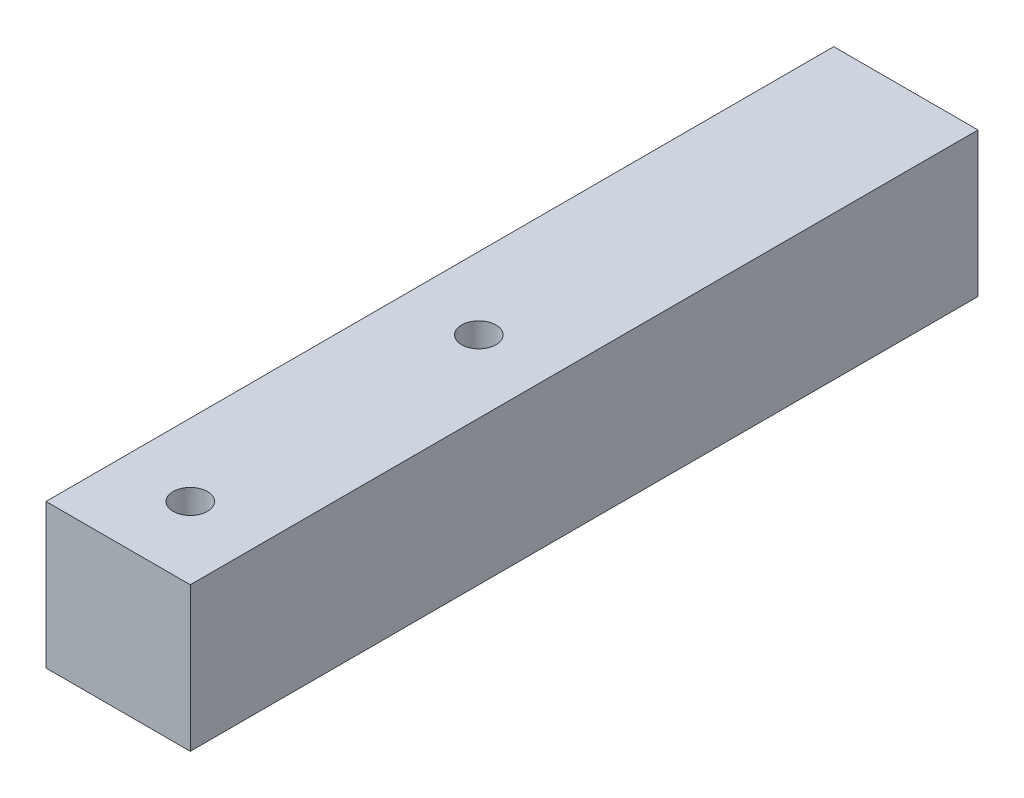
ISO-10303-21;
HEADER;
FILE_DESCRIPTION(('STEP AP214'),'2;1');
FILE_NAME('part.step','',(''),(''),'','','');
FILE_SCHEMA(('AUTOMOTIVE_DESIGN { 1 0 10303 214 1 1 1 1 }'));
ENDSEC;
DATA;
#1=APPLICATION_CONTEXT('core data for automotive mechanical design processes');
#2=APPLICATION_PROTOCOL_DEFINITION('international standard','automotive_design',2000,#1);
#3=PRODUCT_CONTEXT('',#1,'mechanical');
#4=PRODUCT('Part','Part','',(#3));
#5=PRODUCT_RELATED_PRODUCT_CATEGORY('part','',(#4));
#6=PRODUCT_DEFINITION_FORMATION('','',#4);
#7=PRODUCT_DEFINITION_CONTEXT('part definition',#1,'design');
#8=PRODUCT_DEFINITION('design','',#6,#7);
#9=PRODUCT_DEFINITION_SHAPE('','',#8);
#10=(LENGTH_UNIT() NAMED_UNIT(*) SI_UNIT(.MILLI.,.METRE.));
#11=(NAMED_UNIT(*) PLANE_ANGLE_UNIT() SI_UNIT($,.RADIAN.));
#12=(NAMED_UNIT(*) SI_UNIT($,.STERADIAN.) SOLID_ANGLE_UNIT());
#13=UNCERTAINTY_MEASURE_WITH_UNIT(LENGTH_MEASURE(1.E-05),#10,'distance_accuracy_value','');
#14=(GEOMETRIC_REPRESENTATION_CONTEXT(3) GLOBAL_UNCERTAINTY_ASSIGNED_CONTEXT((#13)) GLOBAL_UNIT_ASSIGNED_CONTEXT((#10,
#11,#12)) REPRESENTATION_CONTEXT('',''));
#15=CARTESIAN_POINT('',(0.,0.,0.));
#16=DIRECTION('',(0.,0.,1.));
#17=DIRECTION('',(1.,0.,0.));
#18=AXIS2_PLACEMENT_3D('',#15,#16,#17);
#19=CARTESIAN_POINT('',(12.7,-12.7,69.341499747));
#20=DIRECTION('',(-1.,0.,0.));
#21=DIRECTION('',(0.,0.,1.));
#22=AXIS2_PLACEMENT_3D('',#19,#20,#21);
#23=PLANE('',#22);
#24=DIRECTION('',(0.,1.,0.));
#25=VECTOR('',#24,1.);
#26=CARTESIAN_POINT('',(12.7,-12.7,-69.341499747));
#27=LINE('',#26,#25);
#28=CARTESIAN_POINT('',(12.7,-12.7,-69.341499747));
#29=VERTEX_POINT('',#28);
#30=CARTESIAN_POINT('',(12.7,12.7,-69.341499747));
#31=VERTEX_POINT('',#30);
#32=EDGE_CURVE('E104',#29,#31,#27,.T.);
#33=ORIENTED_EDGE('',*,*,#32,.T.);
#34=DIRECTION('',(0.,0.,-1.));
#35=VECTOR('',#34,1.);
#36=CARTESIAN_POINT('',(12.7,12.7,69.341499747));
#37=LINE('',#36,#35);
#38=CARTESIAN_POINT('',(12.7,12.7,69.341499747));
#39=VERTEX_POINT('',#38);
#40=EDGE_CURVE('E11',#39,#31,#37,.T.);
#41=ORIENTED_EDGE('',*,*,#40,.F.);
#42=DIRECTION('',(0.,1.,0.));
#43=VECTOR('',#42,1.);
#44=CARTESIAN_POINT('',(12.7,-12.7,69.341499747));
#45=LINE('',#44,#43);
#46=CARTESIAN_POINT('',(12.7,-12.7,69.341499747));
#47=VERTEX_POINT('',#46);
#48=EDGE_CURVE('E92',#47,#39,#45,.T.);
#49=ORIENTED_EDGE('',*,*,#48,.F.);
#50=DIRECTION('',(0.,0.,-1.));
#51=VECTOR('',#50,1.);
#52=CARTESIAN_POINT('',(12.7,-12.7,69.341499747));
#53=LINE('',#52,#51);
#54=EDGE_CURVE('E100',#47,#29,#53,.T.);
#55=ORIENTED_EDGE('',*,*,#54,.T.);
#56=EDGE_LOOP('',(#33,#41,#49,#55));
#57=FACE_BOUND('',#56,.T.);
#58=ADVANCED_FACE('F41',(#57),#23,.F.);
#59=CARTESIAN_POINT('',(-12.7,12.7,69.341499747));
#60=DIRECTION('',(0.,-1.,0.));
#61=DIRECTION('',(0.,0.,-1.));
#62=AXIS2_PLACEMENT_3D('',#59,#60,#61);
#63=PLANE('',#62);
#64=CARTESIAN_POINT('',(0.,12.7,5.841499747));
#65=DIRECTION('',(0.,-1.,0.));
#66=DIRECTION('',(0.,0.,-1.));
#67=AXIS2_PLACEMENT_3D('',#64,#65,#66);
#68=CIRCLE('',#67,3.025);
#69=CARTESIAN_POINT('',(0.,12.7,2.81649974700001));
#70=VERTEX_POINT('',#69);
#71=EDGE_CURVE('E123',#70,#70,#68,.T.);
#72=ORIENTED_EDGE('',*,*,#71,.T.);
#73=EDGE_LOOP('',(#72));
#74=FACE_BOUND('',#73,.T.);
#75=CARTESIAN_POINT('',(0.,12.7,56.641499747));
#76=DIRECTION('',(0.,-1.,0.));
#77=DIRECTION('',(0.,0.,-1.));
#78=AXIS2_PLACEMENT_3D('',#75,#76,#77);
#79=CIRCLE('',#78,3.025);
#80=CARTESIAN_POINT('',(0.,12.7,53.616499747));
#81=VERTEX_POINT('',#80);
#82=EDGE_CURVE('E107',#81,#81,#79,.T.);
#83=ORIENTED_EDGE('',*,*,#82,.T.);
#84=EDGE_LOOP('',(#83));
#85=FACE_BOUND('',#84,.T.);
#86=DIRECTION('',(-1.,0.,0.));
#87=VECTOR('',#86,1.);
#88=CARTESIAN_POINT('',(-12.7,12.7,-69.341499747));
#89=LINE('',#88,#87);
#90=CARTESIAN_POINT('',(-12.7,12.7,-69.341499747));
#91=VERTEX_POINT('',#90);
#92=EDGE_CURVE('E96',#31,#91,#89,.T.);
#93=ORIENTED_EDGE('',*,*,#92,.T.);
#94=DIRECTION('',(0.,0.,-1.));
#95=VECTOR('',#94,1.);
#96=CARTESIAN_POINT('',(-12.7,12.7,69.341499747));
#97=LINE('',#96,#95);
#98=CARTESIAN_POINT('',(-12.7,12.7,69.341499747));
#99=VERTEX_POINT('',#98);
#100=EDGE_CURVE('E49',#99,#91,#97,.T.);
#101=ORIENTED_EDGE('',*,*,#100,.F.);
#102=DIRECTION('',(-1.,0.,0.));
#103=VECTOR('',#102,1.);
#104=CARTESIAN_POINT('',(-12.7,12.7,69.341499747));
#105=LINE('',#104,#103);
#106=EDGE_CURVE('E87',#39,#99,#105,.T.);
#107=ORIENTED_EDGE('',*,*,#106,.F.);
#108=ORIENTED_EDGE('',*,*,#40,.T.);
#109=EDGE_LOOP('',(#93,#101,#107,#108));
#110=FACE_BOUND('',#109,.T.);
#111=ADVANCED_FACE('F95',(#74,#85,#110),#63,.F.);
#112=CARTESIAN_POINT('',(-12.7,-12.7,69.341499747));
#113=DIRECTION('',(1.,0.,0.));
#114=DIRECTION('',(0.,0.,-1.));
#115=AXIS2_PLACEMENT_3D('',#112,#113,#114);
#116=PLANE('',#115);
#117=DIRECTION('',(0.,-1.,0.));
#118=VECTOR('',#117,1.);
#119=CARTESIAN_POINT('',(-12.7,-12.7,-69.341499747));
#120=LINE('',#119,#118);
#121=CARTESIAN_POINT('',(-12.7,-12.7,-69.341499747));
#122=VERTEX_POINT('',#121);
#123=EDGE_CURVE('E74',#91,#122,#120,.T.);
#124=ORIENTED_EDGE('',*,*,#123,.T.);
#125=DIRECTION('',(0.,0.,-1.));
#126=VECTOR('',#125,1.);
#127=CARTESIAN_POINT('',(-12.7,-12.7,69.341499747));
#128=LINE('',#127,#126);
#129=CARTESIAN_POINT('',(-12.7,-12.7,69.341499747));
#130=VERTEX_POINT('',#129);
#131=EDGE_CURVE('E97',#130,#122,#128,.T.);
#132=ORIENTED_EDGE('',*,*,#131,.F.);
#133=DIRECTION('',(0.,-1.,0.));
#134=VECTOR('',#133,1.);
#135=CARTESIAN_POINT('',(-12.7,-12.7,69.341499747));
#136=LINE('',#135,#134);
#137=EDGE_CURVE('E90',#99,#130,#136,.T.);
#138=ORIENTED_EDGE('',*,*,#137,.F.);
#139=ORIENTED_EDGE('',*,*,#100,.T.);
#140=EDGE_LOOP('',(#124,#132,#138,#139));
#141=FACE_BOUND('',#140,.T.);
#142=ADVANCED_FACE('F98',(#141),#116,.F.);
#143=CARTESIAN_POINT('',(-12.7,-12.7,69.341499747));
#144=DIRECTION('',(0.,1.,0.));
#145=DIRECTION('',(0.,0.,1.));
#146=AXIS2_PLACEMENT_3D('',#143,#144,#145);
#147=PLANE('',#146);
#148=CARTESIAN_POINT('',(0.,-12.7,5.841499747));
#149=DIRECTION('',(0.,-1.,0.));
#150=DIRECTION('',(0.,0.,-1.));
#151=AXIS2_PLACEMENT_3D('',#148,#149,#150);
#152=CIRCLE('',#151,3.02499999999999);
#153=CARTESIAN_POINT('',(0.,-12.7,2.81649974700002));
#154=VERTEX_POINT('',#153);
#155=EDGE_CURVE('E126',#154,#154,#152,.T.);
#156=ORIENTED_EDGE('',*,*,#155,.F.);
#157=EDGE_LOOP('',(#156));
#158=FACE_BOUND('',#157,.T.);
#159=CARTESIAN_POINT('',(0.,-12.7,56.641499747));
#160=DIRECTION('',(0.,-1.,0.));
#161=DIRECTION('',(0.,0.,-1.));
#162=AXIS2_PLACEMENT_3D('',#159,#160,#161);
#163=CIRCLE('',#162,3.02499999999999);
#164=CARTESIAN_POINT('',(0.,-12.7,53.616499747));
#165=VERTEX_POINT('',#164);
#166=EDGE_CURVE('E120',#165,#165,#163,.T.);
#167=ORIENTED_EDGE('',*,*,#166,.F.);
#168=EDGE_LOOP('',(#167));
#169=FACE_BOUND('',#168,.T.);
#170=DIRECTION('',(1.,0.,0.));
#171=VECTOR('',#170,1.);
#172=CARTESIAN_POINT('',(-12.7,-12.7,-69.341499747));
#173=LINE('',#172,#171);
#174=EDGE_CURVE('E80',#122,#29,#173,.T.);
#175=ORIENTED_EDGE('',*,*,#174,.T.);
#176=ORIENTED_EDGE('',*,*,#54,.F.);
#177=DIRECTION('',(1.,0.,0.));
#178=VECTOR('',#177,1.);
#179=CARTESIAN_POINT('',(-12.7,-12.7,69.341499747));
#180=LINE('',#179,#178);
#181=EDGE_CURVE('E57',#130,#47,#180,.T.);
#182=ORIENTED_EDGE('',*,*,#181,.F.);
#183=ORIENTED_EDGE('',*,*,#131,.T.);
#184=EDGE_LOOP('',(#175,#176,#182,#183));
#185=FACE_BOUND('',#184,.T.);
#186=ADVANCED_FACE('F112',(#158,#169,#185),#147,.F.);
#187=CARTESIAN_POINT('',(0.,0.,69.341499747));
#188=DIRECTION('',(0.,0.,-1.));
#189=DIRECTION('',(-1.,0.,0.));
#190=AXIS2_PLACEMENT_3D('',#187,#188,#189);
#191=PLANE('',#190);
#192=ORIENTED_EDGE('',*,*,#48,.T.);
#193=ORIENTED_EDGE('',*,*,#106,.T.);
#194=ORIENTED_EDGE('',*,*,#137,.T.);
#195=ORIENTED_EDGE('',*,*,#181,.T.);
#196=EDGE_LOOP('',(#192,#193,#194,#195));
#197=FACE_BOUND('',#196,.T.);
#198=ADVANCED_FACE('F88',(#197),#191,.F.);
#199=CARTESIAN_POINT('',(0.,0.,-69.341499747));
#200=DIRECTION('',(0.,0.,-1.));
#201=DIRECTION('',(-1.,0.,0.));
#202=AXIS2_PLACEMENT_3D('',#199,#200,#201);
#203=PLANE('',#202);
#204=CARTESIAN_POINT('',(0.,0.,-69.341499747));
#205=DIRECTION('',(0.,0.,-1.));
#206=DIRECTION('',(-1.,0.,0.));
#207=AXIS2_PLACEMENT_3D('',#204,#205,#206);
#208=CIRCLE('',#207,2.625);
#209=CARTESIAN_POINT('',(-2.625,0.,-69.341499747));
#210=VERTEX_POINT('',#209);
#211=EDGE_CURVE('E132',#210,#210,#208,.T.);
#212=ORIENTED_EDGE('',*,*,#211,.F.);
#213=EDGE_LOOP('',(#212));
#214=FACE_BOUND('',#213,.T.);
#215=ORIENTED_EDGE('',*,*,#32,.F.);
#216=ORIENTED_EDGE('',*,*,#174,.F.);
#217=ORIENTED_EDGE('',*,*,#123,.F.);
#218=ORIENTED_EDGE('',*,*,#92,.F.);
#219=EDGE_LOOP('',(#215,#216,#217,#218));
#220=FACE_BOUND('',#219,.T.);
#221=ADVANCED_FACE('F115',(#214,#220),#203,.T.);
#222=CARTESIAN_POINT('',(0.,-12.7,56.641499747));
#223=DIRECTION('',(0.,-1.,0.));
#224=DIRECTION('',(0.,0.,-1.));
#225=AXIS2_PLACEMENT_3D('',#222,#223,#224);
#226=CYLINDRICAL_SURFACE('',#225,3.02499999999999);
#227=ORIENTED_EDGE('',*,*,#82,.F.);
#228=EDGE_LOOP('',(#227));
#229=FACE_BOUND('',#228,.T.);
#230=ORIENTED_EDGE('',*,*,#166,.T.);
#231=EDGE_LOOP('',(#230));
#232=FACE_BOUND('',#231,.T.);
#233=ADVANCED_FACE('F139',(#229,#232),#226,.F.);
#234=CARTESIAN_POINT('',(0.,-12.7,5.841499747));
#235=DIRECTION('',(0.,-1.,0.));
#236=DIRECTION('',(0.,0.,-1.));
#237=AXIS2_PLACEMENT_3D('',#234,#235,#236);
#238=CYLINDRICAL_SURFACE('',#237,3.02499999999999);
#239=ORIENTED_EDGE('',*,*,#71,.F.);
#240=EDGE_LOOP('',(#239));
#241=FACE_BOUND('',#240,.T.);
#242=ORIENTED_EDGE('',*,*,#155,.T.);
#243=EDGE_LOOP('',(#242));
#244=FACE_BOUND('',#243,.T.);
#245=ADVANCED_FACE('F146',(#241,#244),#238,.F.);
#246=CARTESIAN_POINT('',(0.,0.,-54.609499747));
#247=DIRECTION('',(0.,0.,1.));
#248=DIRECTION('',(1.,0.,0.));
#249=AXIS2_PLACEMENT_3D('',#246,#247,#248);
#250=PLANE('',#249);
#251=CARTESIAN_POINT('',(0.,0.,-54.609499747));
#252=DIRECTION('',(0.,0.,-1.));
#253=DIRECTION('',(-1.,0.,0.));
#254=AXIS2_PLACEMENT_3D('',#251,#252,#253);
#255=CIRCLE('',#254,2.625);
#256=CARTESIAN_POINT('',(-2.625,0.,-54.609499747));
#257=VERTEX_POINT('',#256);
#258=EDGE_CURVE('E129',#257,#257,#255,.T.);
#259=ORIENTED_EDGE('',*,*,#258,.T.);
#260=EDGE_LOOP('',(#259));
#261=FACE_BOUND('',#260,.T.);
#262=ADVANCED_FACE('F174',(#261),#250,.F.);
#263=CARTESIAN_POINT('',(0.,0.,-69.341499747));
#264=DIRECTION('',(0.,0.,-1.));
#265=DIRECTION('',(-1.,0.,0.));
#266=AXIS2_PLACEMENT_3D('',#263,#264,#265);
#267=CYLINDRICAL_SURFACE('',#266,2.625);
#268=ORIENTED_EDGE('',*,*,#258,.F.);
#269=EDGE_LOOP('',(#268));
#270=FACE_BOUND('',#269,.T.);
#271=ORIENTED_EDGE('',*,*,#211,.T.);
#272=EDGE_LOOP('',(#271));
#273=FACE_BOUND('',#272,.T.);
#274=ADVANCED_FACE('F136',(#270,#273),#267,.F.);
#275=CLOSED_SHELL('',(#58,#111,#142,#186,#198,#221,#233,#245,#262,#274));
#276=MANIFOLD_SOLID_BREP('B2',#275);
#277=ADVANCED_BREP_SHAPE_REPRESENTATION('',(#18,#276),#14);
#278=SHAPE_DEFINITION_REPRESENTATION(#9,#277);
ENDSEC;
END-ISO-10303-21;
